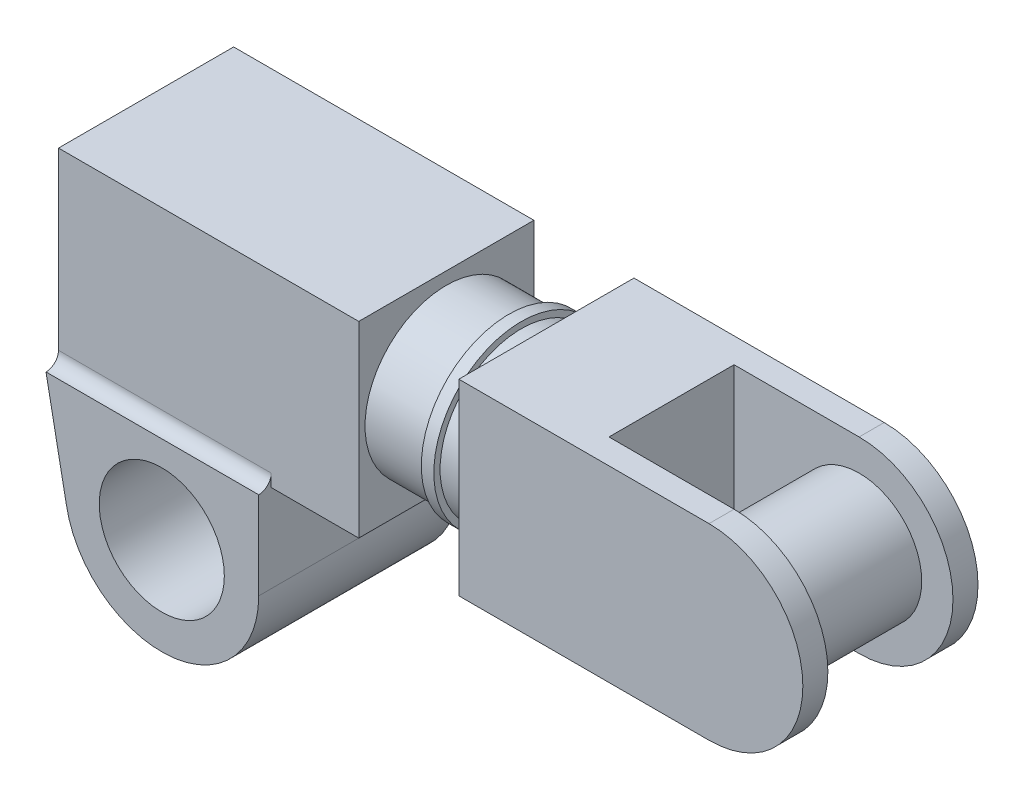
ISO-10303-21;
HEADER;
FILE_DESCRIPTION(('STEP AP214'),'2;1');
FILE_NAME('part.step','',(''),(''),'','','');
FILE_SCHEMA(('AUTOMOTIVE_DESIGN { 1 0 10303 214 1 1 1 1 }'));
ENDSEC;
DATA;
#1=APPLICATION_CONTEXT('core data for automotive mechanical design processes');
#2=APPLICATION_PROTOCOL_DEFINITION('international standard','automotive_design',2000,#1);
#3=PRODUCT_CONTEXT('',#1,'mechanical');
#4=PRODUCT('Part','Part','',(#3));
#5=PRODUCT_RELATED_PRODUCT_CATEGORY('part','',(#4));
#6=PRODUCT_DEFINITION_FORMATION('','',#4);
#7=PRODUCT_DEFINITION_CONTEXT('part definition',#1,'design');
#8=PRODUCT_DEFINITION('design','',#6,#7);
#9=PRODUCT_DEFINITION_SHAPE('','',#8);
#10=(LENGTH_UNIT() NAMED_UNIT(*) SI_UNIT(.MILLI.,.METRE.));
#11=(NAMED_UNIT(*) PLANE_ANGLE_UNIT() SI_UNIT($,.RADIAN.));
#12=(NAMED_UNIT(*) SI_UNIT($,.STERADIAN.) SOLID_ANGLE_UNIT());
#13=UNCERTAINTY_MEASURE_WITH_UNIT(LENGTH_MEASURE(1.E-05),#10,'distance_accuracy_value','');
#14=(GEOMETRIC_REPRESENTATION_CONTEXT(3) GLOBAL_UNCERTAINTY_ASSIGNED_CONTEXT((#13)) GLOBAL_UNIT_ASSIGNED_CONTEXT((#10,
#11,#12)) REPRESENTATION_CONTEXT('',''));
#15=CARTESIAN_POINT('',(0.,0.,0.));
#16=DIRECTION('',(0.,0.,1.));
#17=DIRECTION('',(1.,0.,0.));
#18=AXIS2_PLACEMENT_3D('',#15,#16,#17);
#19=CARTESIAN_POINT('',(320.,75.,70.));
#20=DIRECTION('',(0.,-1.,0.));
#21=DIRECTION('',(1.,0.,0.));
#22=AXIS2_PLACEMENT_3D('',#19,#20,#21);
#23=PLANE('',#22);
#24=DIRECTION('',(-1.,0.,0.));
#25=VECTOR('',#24,1.);
#26=CARTESIAN_POINT('',(520.,75.,-50.));
#27=LINE('',#26,#25);
#28=CARTESIAN_POINT('',(520.,75.,-50.));
#29=VERTEX_POINT('',#28);
#30=CARTESIAN_POINT('',(420.,75.,-50.));
#31=VERTEX_POINT('',#30);
#32=EDGE_CURVE('E356',#29,#31,#27,.T.);
#33=ORIENTED_EDGE('',*,*,#32,.F.);
#34=DIRECTION('',(0.,0.,-1.));
#35=VECTOR('',#34,1.);
#36=CARTESIAN_POINT('',(520.,75.,70.));
#37=LINE('',#36,#35);
#38=CARTESIAN_POINT('',(520.,75.,-70.));
#39=VERTEX_POINT('',#38);
#40=EDGE_CURVE('E293',#29,#39,#37,.T.);
#41=ORIENTED_EDGE('',*,*,#40,.T.);
#42=DIRECTION('',(-1.,0.,0.));
#43=VECTOR('',#42,1.);
#44=CARTESIAN_POINT('',(320.,75.,-70.));
#45=LINE('',#44,#43);
#46=CARTESIAN_POINT('',(320.,75.,-70.));
#47=VERTEX_POINT('',#46);
#48=EDGE_CURVE('E307',#39,#47,#45,.T.);
#49=ORIENTED_EDGE('',*,*,#48,.T.);
#50=DIRECTION('',(0.,0.,-1.));
#51=VECTOR('',#50,1.);
#52=CARTESIAN_POINT('',(320.,75.,70.));
#53=LINE('',#52,#51);
#54=CARTESIAN_POINT('',(320.,75.,70.));
#55=VERTEX_POINT('',#54);
#56=EDGE_CURVE('E276',#55,#47,#53,.T.);
#57=ORIENTED_EDGE('',*,*,#56,.F.);
#58=DIRECTION('',(-1.,0.,0.));
#59=VECTOR('',#58,1.);
#60=CARTESIAN_POINT('',(320.,75.,70.));
#61=LINE('',#60,#59);
#62=CARTESIAN_POINT('',(520.,75.,70.));
#63=VERTEX_POINT('',#62);
#64=EDGE_CURVE('E298',#63,#55,#61,.T.);
#65=ORIENTED_EDGE('',*,*,#64,.F.);
#66=CARTESIAN_POINT('',(520.,75.,50.));
#67=VERTEX_POINT('',#66);
#68=EDGE_CURVE('E289',#63,#67,#37,.T.);
#69=ORIENTED_EDGE('',*,*,#68,.T.);
#70=DIRECTION('',(-1.,0.,0.));
#71=VECTOR('',#70,1.);
#72=CARTESIAN_POINT('',(520.,75.,50.));
#73=LINE('',#72,#71);
#74=CARTESIAN_POINT('',(420.,75.,50.));
#75=VERTEX_POINT('',#74);
#76=EDGE_CURVE('E58',#67,#75,#73,.T.);
#77=ORIENTED_EDGE('',*,*,#76,.T.);
#78=DIRECTION('',(0.,0.,1.));
#79=VECTOR('',#78,1.);
#80=CARTESIAN_POINT('',(420.,75.,-50.));
#81=LINE('',#80,#79);
#82=EDGE_CURVE('E327',#31,#75,#81,.T.);
#83=ORIENTED_EDGE('',*,*,#82,.F.);
#84=EDGE_LOOP('',(#33,#41,#49,#57,#65,#69,#77,#83));
#85=FACE_BOUND('',#84,.T.);
#86=ADVANCED_FACE('F42',(#85),#23,.F.);
#87=CARTESIAN_POINT('',(520.,-75.,70.));
#88=DIRECTION('',(0.,1.,0.));
#89=DIRECTION('',(-1.,0.,0.));
#90=AXIS2_PLACEMENT_3D('',#87,#88,#89);
#91=PLANE('',#90);
#92=DIRECTION('',(1.,0.,0.));
#93=VECTOR('',#92,1.);
#94=CARTESIAN_POINT('',(420.,-75.,-50.));
#95=LINE('',#94,#93);
#96=CARTESIAN_POINT('',(420.,-75.,-50.));
#97=VERTEX_POINT('',#96);
#98=CARTESIAN_POINT('',(520.,-75.,-50.));
#99=VERTEX_POINT('',#98);
#100=EDGE_CURVE('E331',#97,#99,#95,.T.);
#101=ORIENTED_EDGE('',*,*,#100,.F.);
#102=DIRECTION('',(0.,0.,1.));
#103=VECTOR('',#102,1.);
#104=CARTESIAN_POINT('',(420.,-75.,-50.));
#105=LINE('',#104,#103);
#106=CARTESIAN_POINT('',(420.,-75.,50.));
#107=VERTEX_POINT('',#106);
#108=EDGE_CURVE('E311',#97,#107,#105,.T.);
#109=ORIENTED_EDGE('',*,*,#108,.T.);
#110=DIRECTION('',(1.,0.,0.));
#111=VECTOR('',#110,1.);
#112=CARTESIAN_POINT('',(420.,-75.,50.));
#113=LINE('',#112,#111);
#114=CARTESIAN_POINT('',(520.,-75.,50.));
#115=VERTEX_POINT('',#114);
#116=EDGE_CURVE('E335',#107,#115,#113,.T.);
#117=ORIENTED_EDGE('',*,*,#116,.T.);
#118=DIRECTION('',(0.,0.,-1.));
#119=VECTOR('',#118,1.);
#120=CARTESIAN_POINT('',(520.,-75.,70.));
#121=LINE('',#120,#119);
#122=CARTESIAN_POINT('',(520.,-75.,70.));
#123=VERTEX_POINT('',#122);
#124=EDGE_CURVE('E284',#123,#115,#121,.T.);
#125=ORIENTED_EDGE('',*,*,#124,.F.);
#126=DIRECTION('',(1.,0.,0.));
#127=VECTOR('',#126,1.);
#128=CARTESIAN_POINT('',(520.,-75.,70.));
#129=LINE('',#128,#127);
#130=CARTESIAN_POINT('',(320.,-75.,70.));
#131=VERTEX_POINT('',#130);
#132=EDGE_CURVE('E316',#131,#123,#129,.T.);
#133=ORIENTED_EDGE('',*,*,#132,.F.);
#134=DIRECTION('',(0.,0.,-1.));
#135=VECTOR('',#134,1.);
#136=CARTESIAN_POINT('',(320.,-75.,70.));
#137=LINE('',#136,#135);
#138=CARTESIAN_POINT('',(320.,-75.,-70.));
#139=VERTEX_POINT('',#138);
#140=EDGE_CURVE('E280',#131,#139,#137,.T.);
#141=ORIENTED_EDGE('',*,*,#140,.T.);
#142=DIRECTION('',(1.,0.,0.));
#143=VECTOR('',#142,1.);
#144=CARTESIAN_POINT('',(520.,-75.,-70.));
#145=LINE('',#144,#143);
#146=CARTESIAN_POINT('',(520.,-75.,-70.));
#147=VERTEX_POINT('',#146);
#148=EDGE_CURVE('E299',#139,#147,#145,.T.);
#149=ORIENTED_EDGE('',*,*,#148,.T.);
#150=EDGE_CURVE('E288',#99,#147,#121,.T.);
#151=ORIENTED_EDGE('',*,*,#150,.F.);
#152=EDGE_LOOP('',(#101,#109,#117,#125,#133,#141,#149,#151));
#153=FACE_BOUND('',#152,.T.);
#154=ADVANCED_FACE('F429',(#153),#91,.F.);
#155=CARTESIAN_POINT('',(520.,0.,70.));
#156=DIRECTION('',(0.,0.,-1.));
#157=DIRECTION('',(-1.,0.,0.));
#158=AXIS2_PLACEMENT_3D('',#155,#156,#157);
#159=CYLINDRICAL_SURFACE('',#158,75.);
#160=CARTESIAN_POINT('',(520.,0.,-50.));
#161=DIRECTION('',(0.,0.,1.));
#162=DIRECTION('',(1.,0.,0.));
#163=AXIS2_PLACEMENT_3D('',#160,#161,#162);
#164=CIRCLE('',#163,75.);
#165=EDGE_CURVE('E339',#99,#29,#164,.T.);
#166=ORIENTED_EDGE('',*,*,#165,.F.);
#167=ORIENTED_EDGE('',*,*,#150,.T.);
#168=CARTESIAN_POINT('',(520.,0.,-70.));
#169=DIRECTION('',(0.,0.,1.));
#170=DIRECTION('',(1.,0.,0.));
#171=AXIS2_PLACEMENT_3D('',#168,#169,#170);
#172=CIRCLE('',#171,75.);
#173=EDGE_CURVE('E294',#147,#39,#172,.T.);
#174=ORIENTED_EDGE('',*,*,#173,.T.);
#175=ORIENTED_EDGE('',*,*,#40,.F.);
#176=EDGE_LOOP('',(#166,#167,#174,#175));
#177=FACE_BOUND('',#176,.T.);
#178=ADVANCED_FACE('F393',(#177),#159,.T.);
#179=CARTESIAN_POINT('',(240.,-75.,70.));
#180=DIRECTION('',(0.,0.,-1.));
#181=DIRECTION('',(-1.,0.,0.));
#182=AXIS2_PLACEMENT_3D('',#179,#180,#181);
#183=PLANE('',#182);
#184=DIRECTION('',(0.,-1.,0.));
#185=VECTOR('',#184,1.);
#186=CARTESIAN_POINT('',(0.,-75.,70.));
#187=LINE('',#186,#185);
#188=CARTESIAN_POINT('',(0.,75.,70.));
#189=VERTEX_POINT('',#188);
#190=CARTESIAN_POINT('',(0.,-65.,70.));
#191=VERTEX_POINT('',#190);
#192=EDGE_CURVE('E150',#189,#191,#187,.T.);
#193=ORIENTED_EDGE('',*,*,#192,.T.);
#194=DIRECTION('',(-1.,0.,0.));
#195=VECTOR('',#194,1.);
#196=CARTESIAN_POINT('',(170.044787747247,-65.,70.));
#197=LINE('',#196,#195);
#198=CARTESIAN_POINT('',(170.044787747247,-65.,70.));
#199=VERTEX_POINT('',#198);
#200=EDGE_CURVE('E144',#191,#199,#197,.F.);
#201=ORIENTED_EDGE('',*,*,#200,.T.);
#202=DIRECTION('',(0.,-1.,0.));
#203=VECTOR('',#202,1.);
#204=CARTESIAN_POINT('',(170.044787747247,-145.,70.));
#205=LINE('',#204,#203);
#206=CARTESIAN_POINT('',(170.044787747247,-75.,70.));
#207=VERTEX_POINT('',#206);
#208=EDGE_CURVE('E135',#199,#207,#205,.T.);
#209=ORIENTED_EDGE('',*,*,#208,.T.);
#210=DIRECTION('',(-1.,0.,0.));
#211=VECTOR('',#210,1.);
#212=CARTESIAN_POINT('',(240.,-75.,70.));
#213=LINE('',#212,#211);
#214=CARTESIAN_POINT('',(240.,-75.,70.));
#215=VERTEX_POINT('',#214);
#216=EDGE_CURVE('E176',#215,#207,#213,.T.);
#217=ORIENTED_EDGE('',*,*,#216,.F.);
#218=DIRECTION('',(0.,-1.,0.));
#219=VECTOR('',#218,1.);
#220=CARTESIAN_POINT('',(240.,-75.,70.));
#221=LINE('',#220,#219);
#222=CARTESIAN_POINT('',(240.,75.,70.));
#223=VERTEX_POINT('',#222);
#224=EDGE_CURVE('E194',#223,#215,#221,.T.);
#225=ORIENTED_EDGE('',*,*,#224,.F.);
#226=DIRECTION('',(-1.,0.,0.));
#227=VECTOR('',#226,1.);
#228=CARTESIAN_POINT('',(240.,75.,70.));
#229=LINE('',#228,#227);
#230=EDGE_CURVE('E187',#223,#189,#229,.T.);
#231=ORIENTED_EDGE('',*,*,#230,.T.);
#232=EDGE_LOOP('',(#193,#201,#209,#217,#225,#231));
#233=FACE_BOUND('',#232,.T.);
#234=ADVANCED_FACE('F148',(#233),#183,.F.);
#235=CARTESIAN_POINT('',(240.,-75.,-70.));
#236=DIRECTION('',(0.,1.,0.));
#237=DIRECTION('',(0.,0.,1.));
#238=AXIS2_PLACEMENT_3D('',#235,#236,#237);
#239=PLANE('',#238);
#240=ORIENTED_EDGE('',*,*,#216,.T.);
#241=DIRECTION('',(0.,0.,-1.));
#242=VECTOR('',#241,1.);
#243=CARTESIAN_POINT('',(170.044787747247,-75.,80.));
#244=LINE('',#243,#242);
#245=CARTESIAN_POINT('',(170.044787747247,-75.,-70.));
#246=VERTEX_POINT('',#245);
#247=EDGE_CURVE('E139',#207,#246,#244,.T.);
#248=ORIENTED_EDGE('',*,*,#247,.T.);
#249=DIRECTION('',(-1.,0.,0.));
#250=VECTOR('',#249,1.);
#251=CARTESIAN_POINT('',(240.,-75.,-70.));
#252=LINE('',#251,#250);
#253=CARTESIAN_POINT('',(240.,-75.,-70.));
#254=VERTEX_POINT('',#253);
#255=EDGE_CURVE('E180',#254,#246,#252,.T.);
#256=ORIENTED_EDGE('',*,*,#255,.F.);
#257=DIRECTION('',(0.,0.,-1.));
#258=VECTOR('',#257,1.);
#259=CARTESIAN_POINT('',(240.,-75.,-70.));
#260=LINE('',#259,#258);
#261=EDGE_CURVE('E208',#215,#254,#260,.T.);
#262=ORIENTED_EDGE('',*,*,#261,.F.);
#263=EDGE_LOOP('',(#240,#248,#256,#262));
#264=FACE_BOUND('',#263,.T.);
#265=ADVANCED_FACE('F517',(#264),#239,.F.);
#266=CARTESIAN_POINT('',(240.,-75.,-70.));
#267=DIRECTION('',(0.,0.,1.));
#268=DIRECTION('',(1.,0.,0.));
#269=AXIS2_PLACEMENT_3D('',#266,#267,#268);
#270=PLANE('',#269);
#271=DIRECTION('',(0.,1.,0.));
#272=VECTOR('',#271,1.);
#273=CARTESIAN_POINT('',(170.044787747247,-145.,-70.));
#274=LINE('',#273,#272);
#275=CARTESIAN_POINT('',(170.044787747247,-65.,-70.));
#276=VERTEX_POINT('',#275);
#277=EDGE_CURVE('E67',#246,#276,#274,.T.);
#278=ORIENTED_EDGE('',*,*,#277,.T.);
#279=DIRECTION('',(-1.,0.,0.));
#280=VECTOR('',#279,1.);
#281=CARTESIAN_POINT('',(0.,-65.,-70.));
#282=LINE('',#281,#280);
#283=CARTESIAN_POINT('',(0.,-65.,-70.));
#284=VERTEX_POINT('',#283);
#285=EDGE_CURVE('E145',#276,#284,#282,.T.);
#286=ORIENTED_EDGE('',*,*,#285,.T.);
#287=DIRECTION('',(0.,1.,0.));
#288=VECTOR('',#287,1.);
#289=CARTESIAN_POINT('',(0.,-75.,-70.));
#290=LINE('',#289,#288);
#291=CARTESIAN_POINT('',(0.,75.,-70.));
#292=VERTEX_POINT('',#291);
#293=EDGE_CURVE('E195',#284,#292,#290,.T.);
#294=ORIENTED_EDGE('',*,*,#293,.T.);
#295=DIRECTION('',(-1.,0.,0.));
#296=VECTOR('',#295,1.);
#297=CARTESIAN_POINT('',(240.,75.,-70.));
#298=LINE('',#297,#296);
#299=CARTESIAN_POINT('',(240.,75.,-70.));
#300=VERTEX_POINT('',#299);
#301=EDGE_CURVE('E183',#300,#292,#298,.T.);
#302=ORIENTED_EDGE('',*,*,#301,.F.);
#303=DIRECTION('',(0.,1.,0.));
#304=VECTOR('',#303,1.);
#305=CARTESIAN_POINT('',(240.,-75.,-70.));
#306=LINE('',#305,#304);
#307=EDGE_CURVE('E205',#254,#300,#306,.T.);
#308=ORIENTED_EDGE('',*,*,#307,.F.);
#309=ORIENTED_EDGE('',*,*,#255,.T.);
#310=EDGE_LOOP('',(#278,#286,#294,#302,#308,#309));
#311=FACE_BOUND('',#310,.T.);
#312=ADVANCED_FACE('F513',(#311),#270,.F.);
#313=CARTESIAN_POINT('',(240.,75.,-70.));
#314=DIRECTION('',(0.,-1.,0.));
#315=DIRECTION('',(0.,0.,-1.));
#316=AXIS2_PLACEMENT_3D('',#313,#314,#315);
#317=PLANE('',#316);
#318=DIRECTION('',(0.,0.,1.));
#319=VECTOR('',#318,1.);
#320=CARTESIAN_POINT('',(0.,75.,-70.));
#321=LINE('',#320,#319);
#322=EDGE_CURVE('E191',#292,#189,#321,.T.);
#323=ORIENTED_EDGE('',*,*,#322,.T.);
#324=ORIENTED_EDGE('',*,*,#230,.F.);
#325=DIRECTION('',(0.,0.,1.));
#326=VECTOR('',#325,1.);
#327=CARTESIAN_POINT('',(240.,75.,-70.));
#328=LINE('',#327,#326);
#329=EDGE_CURVE('E190',#300,#223,#328,.T.);
#330=ORIENTED_EDGE('',*,*,#329,.F.);
#331=ORIENTED_EDGE('',*,*,#301,.T.);
#332=EDGE_LOOP('',(#323,#324,#330,#331));
#333=FACE_BOUND('',#332,.T.);
#334=ADVANCED_FACE('F507',(#333),#317,.F.);
#335=CARTESIAN_POINT('',(240.,0.,0.));
#336=DIRECTION('',(1.,0.,0.));
#337=DIRECTION('',(0.,0.,-1.));
#338=AXIS2_PLACEMENT_3D('',#335,#336,#337);
#339=PLANE('',#338);
#340=CARTESIAN_POINT('',(240.,0.,0.));
#341=DIRECTION('',(1.,0.,0.));
#342=DIRECTION('',(0.,0.,-1.));
#343=AXIS2_PLACEMENT_3D('',#340,#341,#342);
#344=CIRCLE('',#343,65.);
#345=CARTESIAN_POINT('',(240.,0.,-65.));
#346=VERTEX_POINT('',#345);
#347=EDGE_CURVE('E179',#346,#346,#344,.T.);
#348=ORIENTED_EDGE('',*,*,#347,.F.);
#349=EDGE_LOOP('',(#348));
#350=FACE_BOUND('',#349,.T.);
#351=ORIENTED_EDGE('',*,*,#224,.T.);
#352=ORIENTED_EDGE('',*,*,#261,.T.);
#353=ORIENTED_EDGE('',*,*,#307,.T.);
#354=ORIENTED_EDGE('',*,*,#329,.T.);
#355=EDGE_LOOP('',(#351,#352,#353,#354));
#356=FACE_BOUND('',#355,.T.);
#357=ADVANCED_FACE('F504',(#350,#356),#339,.T.);
#358=CARTESIAN_POINT('',(0.,0.,0.));
#359=DIRECTION('',(1.,0.,0.));
#360=DIRECTION('',(0.,0.,-1.));
#361=AXIS2_PLACEMENT_3D('',#358,#359,#360);
#362=PLANE('',#361);
#363=ORIENTED_EDGE('',*,*,#192,.F.);
#364=ORIENTED_EDGE('',*,*,#322,.F.);
#365=ORIENTED_EDGE('',*,*,#293,.F.);
#366=CARTESIAN_POINT('',(0.,-65.,-80.));
#367=DIRECTION('',(1.,0.,0.));
#368=DIRECTION('',(0.,0.,-1.));
#369=AXIS2_PLACEMENT_3D('',#366,#367,#368);
#370=CIRCLE('',#369,10.);
#371=CARTESIAN_POINT('',(0.,-75.,-80.));
#372=VERTEX_POINT('',#371);
#373=EDGE_CURVE('E153',#284,#372,#370,.T.);
#374=ORIENTED_EDGE('',*,*,#373,.T.);
#375=DIRECTION('',(0.,0.,-1.));
#376=VECTOR('',#375,1.);
#377=CARTESIAN_POINT('',(0.,-75.,-70.));
#378=LINE('',#377,#376);
#379=CARTESIAN_POINT('',(0.,-75.,80.));
#380=VERTEX_POINT('',#379);
#381=EDGE_CURVE('E81',#380,#372,#378,.T.);
#382=ORIENTED_EDGE('',*,*,#381,.F.);
#383=CARTESIAN_POINT('',(0.,-65.,80.));
#384=DIRECTION('',(1.,0.,0.));
#385=DIRECTION('',(0.,0.,-1.));
#386=AXIS2_PLACEMENT_3D('',#383,#384,#385);
#387=CIRCLE('',#386,10.);
#388=EDGE_CURVE('E133',#380,#191,#387,.T.);
#389=ORIENTED_EDGE('',*,*,#388,.T.);
#390=EDGE_LOOP('',(#363,#364,#365,#374,#382,#389));
#391=FACE_BOUND('',#390,.T.);
#392=ADVANCED_FACE('F502',(#391),#362,.F.);
#393=CARTESIAN_POINT('',(290.,0.,0.));
#394=DIRECTION('',(-1.,0.,0.));
#395=DIRECTION('',(0.,0.,1.));
#396=AXIS2_PLACEMENT_3D('',#393,#394,#395);
#397=CYLINDRICAL_SURFACE('',#396,65.);
#398=CARTESIAN_POINT('',(290.,0.,0.));
#399=DIRECTION('',(1.,0.,0.));
#400=DIRECTION('',(0.,0.,-1.));
#401=AXIS2_PLACEMENT_3D('',#398,#399,#400);
#402=CIRCLE('',#401,65.);
#403=CARTESIAN_POINT('',(290.,0.,-65.));
#404=VERTEX_POINT('',#403);
#405=EDGE_CURVE('E202',#404,#404,#402,.T.);
#406=ORIENTED_EDGE('',*,*,#405,.F.);
#407=EDGE_LOOP('',(#406));
#408=FACE_BOUND('',#407,.T.);
#409=ORIENTED_EDGE('',*,*,#347,.T.);
#410=EDGE_LOOP('',(#409));
#411=FACE_BOUND('',#410,.T.);
#412=ADVANCED_FACE('F498',(#408,#411),#397,.T.);
#413=CARTESIAN_POINT('',(300.,0.,0.));
#414=DIRECTION('',(-1.,0.,0.));
#415=DIRECTION('',(0.,0.,1.));
#416=AXIS2_PLACEMENT_3D('',#413,#414,#415);
#417=CYLINDRICAL_SURFACE('',#416,70.);
#418=CARTESIAN_POINT('',(300.,0.,0.));
#419=DIRECTION('',(1.,0.,0.));
#420=DIRECTION('',(0.,0.,-1.));
#421=AXIS2_PLACEMENT_3D('',#418,#419,#420);
#422=CIRCLE('',#421,70.);
#423=CARTESIAN_POINT('',(300.,0.,-70.));
#424=VERTEX_POINT('',#423);
#425=EDGE_CURVE('E220',#424,#424,#422,.T.);
#426=ORIENTED_EDGE('',*,*,#425,.F.);
#427=EDGE_LOOP('',(#426));
#428=FACE_BOUND('',#427,.T.);
#429=CARTESIAN_POINT('',(290.,0.,0.));
#430=DIRECTION('',(1.,0.,0.));
#431=DIRECTION('',(0.,0.,-1.));
#432=AXIS2_PLACEMENT_3D('',#429,#430,#431);
#433=CIRCLE('',#432,70.);
#434=CARTESIAN_POINT('',(290.,0.,-70.));
#435=VERTEX_POINT('',#434);
#436=EDGE_CURVE('E221',#435,#435,#433,.T.);
#437=ORIENTED_EDGE('',*,*,#436,.T.);
#438=EDGE_LOOP('',(#437));
#439=FACE_BOUND('',#438,.T.);
#440=ADVANCED_FACE('F491',(#428,#439),#417,.T.);
#441=CARTESIAN_POINT('',(300.,0.,0.));
#442=DIRECTION('',(1.,0.,0.));
#443=DIRECTION('',(0.,0.,-1.));
#444=AXIS2_PLACEMENT_3D('',#441,#442,#443);
#445=PLANE('',#444);
#446=CARTESIAN_POINT('',(300.,0.,0.));
#447=DIRECTION('',(1.,0.,0.));
#448=DIRECTION('',(0.,0.,-1.));
#449=AXIS2_PLACEMENT_3D('',#446,#447,#448);
#450=CIRCLE('',#449,65.);
#451=CARTESIAN_POINT('',(300.,0.,-65.));
#452=VERTEX_POINT('',#451);
#453=EDGE_CURVE('E51',#452,#452,#450,.T.);
#454=ORIENTED_EDGE('',*,*,#453,.F.);
#455=EDGE_LOOP('',(#454));
#456=FACE_BOUND('',#455,.T.);
#457=ORIENTED_EDGE('',*,*,#425,.T.);
#458=EDGE_LOOP('',(#457));
#459=FACE_BOUND('',#458,.T.);
#460=ADVANCED_FACE('F488',(#456,#459),#445,.T.);
#461=CARTESIAN_POINT('',(290.,0.,0.));
#462=DIRECTION('',(1.,0.,0.));
#463=DIRECTION('',(0.,0.,-1.));
#464=AXIS2_PLACEMENT_3D('',#461,#462,#463);
#465=PLANE('',#464);
#466=ORIENTED_EDGE('',*,*,#405,.T.);
#467=EDGE_LOOP('',(#466));
#468=FACE_BOUND('',#467,.T.);
#469=ORIENTED_EDGE('',*,*,#436,.F.);
#470=EDGE_LOOP('',(#469));
#471=FACE_BOUND('',#470,.T.);
#472=ADVANCED_FACE('F474',(#468,#471),#465,.F.);
#473=CARTESIAN_POINT('',(92.5447877472473,-145.,80.));
#474=DIRECTION('',(0.,0.,1.));
#475=DIRECTION('',(1.,0.,0.));
#476=AXIS2_PLACEMENT_3D('',#473,#474,#475);
#477=PLANE('',#476);
#478=CARTESIAN_POINT('',(92.5447877472473,-145.,80.));
#479=DIRECTION('',(0.,0.,1.));
#480=DIRECTION('',(1.,0.,0.));
#481=AXIS2_PLACEMENT_3D('',#478,#479,#480);
#482=CIRCLE('',#481,77.5);
#483=CARTESIAN_POINT('',(16.2187646070058,-158.438310593052,80.));
#484=VERTEX_POINT('',#483);
#485=CARTESIAN_POINT('',(170.044787747247,-145.,80.));
#486=VERTEX_POINT('',#485);
#487=EDGE_CURVE('E242',#484,#486,#482,.T.);
#488=ORIENTED_EDGE('',*,*,#487,.T.);
#489=DIRECTION('',(0.,1.,0.));
#490=VECTOR('',#489,1.);
#491=CARTESIAN_POINT('',(170.044787747247,-145.,80.));
#492=LINE('',#491,#490);
#493=CARTESIAN_POINT('',(170.044787747247,-75.,80.));
#494=VERTEX_POINT('',#493);
#495=EDGE_CURVE('E259',#486,#494,#492,.T.);
#496=ORIENTED_EDGE('',*,*,#495,.T.);
#497=DIRECTION('',(-1.,0.,0.));
#498=VECTOR('',#497,1.);
#499=CARTESIAN_POINT('',(170.044787747247,-75.,80.));
#500=LINE('',#499,#498);
#501=EDGE_CURVE('E157',#494,#380,#500,.T.);
#502=ORIENTED_EDGE('',*,*,#501,.T.);
#503=DIRECTION('',(0.190808995376538,-0.981627183447665,0.));
#504=VECTOR('',#503,1.);
#505=CARTESIAN_POINT('',(16.2187646070058,-158.438310593052,80.));
#506=LINE('',#505,#504);
#507=EDGE_CURVE('E238',#380,#484,#506,.T.);
#508=ORIENTED_EDGE('',*,*,#507,.T.);
#509=EDGE_LOOP('',(#488,#496,#502,#508));
#510=FACE_BOUND('',#509,.T.);
#511=CARTESIAN_POINT('',(92.5447877472473,-145.,80.));
#512=DIRECTION('',(0.,0.,1.));
#513=DIRECTION('',(1.,0.,0.));
#514=AXIS2_PLACEMENT_3D('',#511,#512,#513);
#515=CIRCLE('',#514,50.);
#516=CARTESIAN_POINT('',(142.544787747247,-145.,80.));
#517=VERTEX_POINT('',#516);
#518=EDGE_CURVE('E254',#517,#517,#515,.T.);
#519=ORIENTED_EDGE('',*,*,#518,.F.);
#520=EDGE_LOOP('',(#519));
#521=FACE_BOUND('',#520,.T.);
#522=ADVANCED_FACE('F470',(#510,#521),#477,.T.);
#523=CARTESIAN_POINT('',(92.5447877472473,-145.,-80.));
#524=DIRECTION('',(0.,0.,1.));
#525=DIRECTION('',(1.,0.,0.));
#526=AXIS2_PLACEMENT_3D('',#523,#524,#525);
#527=PLANE('',#526);
#528=CARTESIAN_POINT('',(92.5447877472473,-145.,-80.));
#529=DIRECTION('',(0.,0.,1.));
#530=DIRECTION('',(1.,0.,0.));
#531=AXIS2_PLACEMENT_3D('',#528,#529,#530);
#532=CIRCLE('',#531,77.5);
#533=CARTESIAN_POINT('',(16.2187646070058,-158.438310593052,-80.));
#534=VERTEX_POINT('',#533);
#535=CARTESIAN_POINT('',(170.044787747247,-145.,-80.));
#536=VERTEX_POINT('',#535);
#537=EDGE_CURVE('E250',#534,#536,#532,.T.);
#538=ORIENTED_EDGE('',*,*,#537,.F.);
#539=DIRECTION('',(0.190808995376538,-0.981627183447665,0.));
#540=VECTOR('',#539,1.);
#541=CARTESIAN_POINT('',(16.2187646070058,-158.438310593052,-80.));
#542=LINE('',#541,#540);
#543=EDGE_CURVE('E239',#372,#534,#542,.T.);
#544=ORIENTED_EDGE('',*,*,#543,.F.);
#545=DIRECTION('',(-1.,0.,0.));
#546=VECTOR('',#545,1.);
#547=CARTESIAN_POINT('',(170.044787747247,-75.,-80.));
#548=LINE('',#547,#546);
#549=CARTESIAN_POINT('',(170.044787747247,-75.,-80.));
#550=VERTEX_POINT('',#549);
#551=EDGE_CURVE('E243',#550,#372,#548,.T.);
#552=ORIENTED_EDGE('',*,*,#551,.F.);
#553=DIRECTION('',(0.,1.,0.));
#554=VECTOR('',#553,1.);
#555=CARTESIAN_POINT('',(170.044787747247,-145.,-80.));
#556=LINE('',#555,#554);
#557=EDGE_CURVE('E247',#536,#550,#556,.T.);
#558=ORIENTED_EDGE('',*,*,#557,.F.);
#559=EDGE_LOOP('',(#538,#544,#552,#558));
#560=FACE_BOUND('',#559,.T.);
#561=CARTESIAN_POINT('',(92.5447877472473,-145.,-80.));
#562=DIRECTION('',(0.,0.,1.));
#563=DIRECTION('',(1.,0.,0.));
#564=AXIS2_PLACEMENT_3D('',#561,#562,#563);
#565=CIRCLE('',#564,50.);
#566=CARTESIAN_POINT('',(142.544787747247,-145.,-80.));
#567=VERTEX_POINT('',#566);
#568=EDGE_CURVE('E265',#567,#567,#565,.T.);
#569=ORIENTED_EDGE('',*,*,#568,.T.);
#570=EDGE_LOOP('',(#569));
#571=FACE_BOUND('',#570,.T.);
#572=ADVANCED_FACE('F473',(#560,#571),#527,.F.);
#573=CARTESIAN_POINT('',(92.5447877472473,-145.,80.));
#574=DIRECTION('',(0.,0.,-1.));
#575=DIRECTION('',(-1.,0.,0.));
#576=AXIS2_PLACEMENT_3D('',#573,#574,#575);
#577=CYLINDRICAL_SURFACE('',#576,77.5);
#578=ORIENTED_EDGE('',*,*,#537,.T.);
#579=DIRECTION('',(0.,0.,-1.));
#580=VECTOR('',#579,1.);
#581=CARTESIAN_POINT('',(170.044787747247,-145.,80.));
#582=LINE('',#581,#580);
#583=EDGE_CURVE('E225',#486,#536,#582,.T.);
#584=ORIENTED_EDGE('',*,*,#583,.F.);
#585=ORIENTED_EDGE('',*,*,#487,.F.);
#586=DIRECTION('',(0.,0.,-1.));
#587=VECTOR('',#586,1.);
#588=CARTESIAN_POINT('',(16.2187646070058,-158.438310593052,80.));
#589=LINE('',#588,#587);
#590=EDGE_CURVE('E232',#484,#534,#589,.T.);
#591=ORIENTED_EDGE('',*,*,#590,.T.);
#592=EDGE_LOOP('',(#578,#584,#585,#591));
#593=FACE_BOUND('',#592,.T.);
#594=ADVANCED_FACE('F478',(#593),#577,.T.);
#595=CARTESIAN_POINT('',(170.044787747247,-145.,80.));
#596=DIRECTION('',(-1.,0.,0.));
#597=DIRECTION('',(0.,0.,1.));
#598=AXIS2_PLACEMENT_3D('',#595,#596,#597);
#599=PLANE('',#598);
#600=ORIENTED_EDGE('',*,*,#557,.T.);
#601=CARTESIAN_POINT('',(170.044787747247,-65.,-80.));
#602=DIRECTION('',(-1.,0.,0.));
#603=DIRECTION('',(0.,0.,1.));
#604=AXIS2_PLACEMENT_3D('',#601,#602,#603);
#605=CIRCLE('',#604,10.);
#606=EDGE_CURVE('E165',#550,#276,#605,.T.);
#607=ORIENTED_EDGE('',*,*,#606,.T.);
#608=ORIENTED_EDGE('',*,*,#277,.F.);
#609=ORIENTED_EDGE('',*,*,#247,.F.);
#610=ORIENTED_EDGE('',*,*,#208,.F.);
#611=CARTESIAN_POINT('',(170.044787747247,-65.,80.));
#612=DIRECTION('',(-1.,0.,0.));
#613=DIRECTION('',(0.,0.,1.));
#614=AXIS2_PLACEMENT_3D('',#611,#612,#613);
#615=CIRCLE('',#614,10.);
#616=EDGE_CURVE('E92',#199,#494,#615,.T.);
#617=ORIENTED_EDGE('',*,*,#616,.T.);
#618=ORIENTED_EDGE('',*,*,#495,.F.);
#619=ORIENTED_EDGE('',*,*,#583,.T.);
#620=EDGE_LOOP('',(#600,#607,#608,#609,#610,#617,#618,#619));
#621=FACE_BOUND('',#620,.T.);
#622=ADVANCED_FACE('F137',(#621),#599,.F.);
#623=CARTESIAN_POINT('',(16.2187646070058,-158.438310593052,80.));
#624=DIRECTION('',(0.981627183447665,0.190808995376538,0.));
#625=DIRECTION('',(-0.190808995376538,0.981627183447665,0.));
#626=AXIS2_PLACEMENT_3D('',#623,#624,#625);
#627=PLANE('',#626);
#628=ORIENTED_EDGE('',*,*,#543,.T.);
#629=ORIENTED_EDGE('',*,*,#590,.F.);
#630=ORIENTED_EDGE('',*,*,#507,.F.);
#631=ORIENTED_EDGE('',*,*,#381,.T.);
#632=EDGE_LOOP('',(#628,#629,#630,#631));
#633=FACE_BOUND('',#632,.T.);
#634=ADVANCED_FACE('F468',(#633),#627,.F.);
#635=CARTESIAN_POINT('',(92.5447877472473,-145.,80.));
#636=DIRECTION('',(0.,0.,-1.));
#637=DIRECTION('',(-1.,0.,0.));
#638=AXIS2_PLACEMENT_3D('',#635,#636,#637);
#639=CYLINDRICAL_SURFACE('',#638,50.);
#640=ORIENTED_EDGE('',*,*,#518,.T.);
#641=EDGE_LOOP('',(#640));
#642=FACE_BOUND('',#641,.T.);
#643=ORIENTED_EDGE('',*,*,#568,.F.);
#644=EDGE_LOOP('',(#643));
#645=FACE_BOUND('',#644,.T.);
#646=ADVANCED_FACE('F464',(#642,#645),#639,.F.);
#647=CARTESIAN_POINT('',(240.,-65.,-80.));
#648=DIRECTION('',(1.,0.,0.));
#649=DIRECTION('',(0.,0.,-1.));
#650=AXIS2_PLACEMENT_3D('',#647,#648,#649);
#651=CYLINDRICAL_SURFACE('',#650,10.);
#652=ORIENTED_EDGE('',*,*,#606,.F.);
#653=ORIENTED_EDGE('',*,*,#551,.T.);
#654=ORIENTED_EDGE('',*,*,#373,.F.);
#655=ORIENTED_EDGE('',*,*,#285,.F.);
#656=EDGE_LOOP('',(#652,#653,#654,#655));
#657=FACE_BOUND('',#656,.T.);
#658=ADVANCED_FACE('F467',(#657),#651,.F.);
#659=CARTESIAN_POINT('',(170.044787747247,-65.,80.));
#660=DIRECTION('',(1.,0.,0.));
#661=DIRECTION('',(0.,0.,-1.));
#662=AXIS2_PLACEMENT_3D('',#659,#660,#661);
#663=CYLINDRICAL_SURFACE('',#662,10.);
#664=ORIENTED_EDGE('',*,*,#616,.F.);
#665=ORIENTED_EDGE('',*,*,#200,.F.);
#666=ORIENTED_EDGE('',*,*,#388,.F.);
#667=ORIENTED_EDGE('',*,*,#501,.F.);
#668=EDGE_LOOP('',(#664,#665,#666,#667));
#669=FACE_BOUND('',#668,.T.);
#670=ADVANCED_FACE('F44',(#669),#663,.F.);
#671=CARTESIAN_POINT('',(320.,0.,0.));
#672=DIRECTION('',(-1.,0.,0.));
#673=DIRECTION('',(0.,0.,1.));
#674=AXIS2_PLACEMENT_3D('',#671,#672,#673);
#675=CYLINDRICAL_SURFACE('',#674,65.);
#676=CARTESIAN_POINT('',(320.,0.,0.));
#677=DIRECTION('',(1.,0.,0.));
#678=DIRECTION('',(0.,0.,-1.));
#679=AXIS2_PLACEMENT_3D('',#676,#677,#678);
#680=CIRCLE('',#679,65.);
#681=CARTESIAN_POINT('',(320.,0.,-65.));
#682=VERTEX_POINT('',#681);
#683=EDGE_CURVE('E269',#682,#682,#680,.T.);
#684=ORIENTED_EDGE('',*,*,#683,.F.);
#685=EDGE_LOOP('',(#684));
#686=FACE_BOUND('',#685,.T.);
#687=ORIENTED_EDGE('',*,*,#453,.T.);
#688=EDGE_LOOP('',(#687));
#689=FACE_BOUND('',#688,.T.);
#690=ADVANCED_FACE('F460',(#686,#689),#675,.T.);
#691=CARTESIAN_POINT('',(320.,-75.,70.));
#692=DIRECTION('',(1.,0.,0.));
#693=DIRECTION('',(0.,0.,-1.));
#694=AXIS2_PLACEMENT_3D('',#691,#692,#693);
#695=PLANE('',#694);
#696=ORIENTED_EDGE('',*,*,#683,.T.);
#697=EDGE_LOOP('',(#696));
#698=FACE_BOUND('',#697,.T.);
#699=DIRECTION('',(0.,-1.,0.));
#700=VECTOR('',#699,1.);
#701=CARTESIAN_POINT('',(320.,-75.,-70.));
#702=LINE('',#701,#700);
#703=EDGE_CURVE('E303',#47,#139,#702,.T.);
#704=ORIENTED_EDGE('',*,*,#703,.T.);
#705=ORIENTED_EDGE('',*,*,#140,.F.);
#706=DIRECTION('',(0.,-1.,0.));
#707=VECTOR('',#706,1.);
#708=CARTESIAN_POINT('',(320.,-75.,70.));
#709=LINE('',#708,#707);
#710=EDGE_CURVE('E320',#55,#131,#709,.T.);
#711=ORIENTED_EDGE('',*,*,#710,.F.);
#712=ORIENTED_EDGE('',*,*,#56,.T.);
#713=EDGE_LOOP('',(#704,#705,#711,#712));
#714=FACE_BOUND('',#713,.T.);
#715=ADVANCED_FACE('F435',(#698,#714),#695,.F.);
#716=ORIENTED_EDGE('',*,*,#124,.T.);
#717=CARTESIAN_POINT('',(520.,0.,50.));
#718=DIRECTION('',(0.,0.,1.));
#719=DIRECTION('',(1.,0.,0.));
#720=AXIS2_PLACEMENT_3D('',#717,#718,#719);
#721=CIRCLE('',#720,75.);
#722=EDGE_CURVE('E345',#115,#67,#721,.T.);
#723=ORIENTED_EDGE('',*,*,#722,.T.);
#724=ORIENTED_EDGE('',*,*,#68,.F.);
#725=CARTESIAN_POINT('',(520.,0.,70.));
#726=DIRECTION('',(0.,0.,1.));
#727=DIRECTION('',(1.,0.,0.));
#728=AXIS2_PLACEMENT_3D('',#725,#726,#727);
#729=CIRCLE('',#728,75.);
#730=EDGE_CURVE('E312',#123,#63,#729,.T.);
#731=ORIENTED_EDGE('',*,*,#730,.F.);
#732=EDGE_LOOP('',(#716,#723,#724,#731));
#733=FACE_BOUND('',#732,.T.);
#734=ADVANCED_FACE('F441',(#733),#159,.T.);
#735=CARTESIAN_POINT('',(520.,0.,70.));
#736=DIRECTION('',(0.,0.,1.));
#737=DIRECTION('',(1.,0.,0.));
#738=AXIS2_PLACEMENT_3D('',#735,#736,#737);
#739=PLANE('',#738);
#740=ORIENTED_EDGE('',*,*,#64,.T.);
#741=ORIENTED_EDGE('',*,*,#710,.T.);
#742=ORIENTED_EDGE('',*,*,#132,.T.);
#743=ORIENTED_EDGE('',*,*,#730,.T.);
#744=EDGE_LOOP('',(#740,#741,#742,#743));
#745=FACE_BOUND('',#744,.T.);
#746=ADVANCED_FACE('F437',(#745),#739,.T.);
#747=CARTESIAN_POINT('',(520.,0.,-70.));
#748=DIRECTION('',(0.,0.,1.));
#749=DIRECTION('',(1.,0.,0.));
#750=AXIS2_PLACEMENT_3D('',#747,#748,#749);
#751=PLANE('',#750);
#752=ORIENTED_EDGE('',*,*,#48,.F.);
#753=ORIENTED_EDGE('',*,*,#173,.F.);
#754=ORIENTED_EDGE('',*,*,#148,.F.);
#755=ORIENTED_EDGE('',*,*,#703,.F.);
#756=EDGE_LOOP('',(#752,#753,#754,#755));
#757=FACE_BOUND('',#756,.T.);
#758=ADVANCED_FACE('F401',(#757),#751,.F.);
#759=CARTESIAN_POINT('',(420.,75.,-50.));
#760=DIRECTION('',(-1.,0.,0.));
#761=DIRECTION('',(0.,0.,1.));
#762=AXIS2_PLACEMENT_3D('',#759,#760,#761);
#763=PLANE('',#762);
#764=DIRECTION('',(0.,-1.,0.));
#765=VECTOR('',#764,1.);
#766=CARTESIAN_POINT('',(420.,75.,50.));
#767=LINE('',#766,#765);
#768=EDGE_CURVE('E340',#75,#107,#767,.T.);
#769=ORIENTED_EDGE('',*,*,#768,.T.);
#770=ORIENTED_EDGE('',*,*,#108,.F.);
#771=DIRECTION('',(0.,-1.,0.));
#772=VECTOR('',#771,1.);
#773=CARTESIAN_POINT('',(420.,75.,-50.));
#774=LINE('',#773,#772);
#775=EDGE_CURVE('E352',#31,#97,#774,.T.);
#776=ORIENTED_EDGE('',*,*,#775,.F.);
#777=ORIENTED_EDGE('',*,*,#82,.T.);
#778=EDGE_LOOP('',(#769,#770,#776,#777));
#779=FACE_BOUND('',#778,.T.);
#780=ADVANCED_FACE('F375',(#779),#763,.F.);
#781=CARTESIAN_POINT('',(520.,0.,-50.));
#782=DIRECTION('',(0.,0.,1.));
#783=DIRECTION('',(1.,0.,0.));
#784=AXIS2_PLACEMENT_3D('',#781,#782,#783);
#785=PLANE('',#784);
#786=CARTESIAN_POINT('',(520.,0.,-50.));
#787=DIRECTION('',(0.,0.,1.));
#788=DIRECTION('',(1.,0.,0.));
#789=AXIS2_PLACEMENT_3D('',#786,#787,#788);
#790=CIRCLE('',#789,50.);
#791=CARTESIAN_POINT('',(570.,0.,-50.));
#792=VERTEX_POINT('',#791);
#793=EDGE_CURVE('E348',#792,#792,#790,.T.);
#794=ORIENTED_EDGE('',*,*,#793,.F.);
#795=EDGE_LOOP('',(#794));
#796=FACE_BOUND('',#795,.T.);
#797=ORIENTED_EDGE('',*,*,#165,.T.);
#798=ORIENTED_EDGE('',*,*,#32,.T.);
#799=ORIENTED_EDGE('',*,*,#775,.T.);
#800=ORIENTED_EDGE('',*,*,#100,.T.);
#801=EDGE_LOOP('',(#797,#798,#799,#800));
#802=FACE_BOUND('',#801,.T.);
#803=ADVANCED_FACE('F371',(#796,#802),#785,.T.);
#804=CARTESIAN_POINT('',(520.,0.,50.));
#805=DIRECTION('',(0.,0.,1.));
#806=DIRECTION('',(1.,0.,0.));
#807=AXIS2_PLACEMENT_3D('',#804,#805,#806);
#808=PLANE('',#807);
#809=CARTESIAN_POINT('',(520.,0.,50.));
#810=DIRECTION('',(0.,0.,1.));
#811=DIRECTION('',(1.,0.,0.));
#812=AXIS2_PLACEMENT_3D('',#809,#810,#811);
#813=CIRCLE('',#812,50.);
#814=CARTESIAN_POINT('',(570.,0.,50.));
#815=VERTEX_POINT('',#814);
#816=EDGE_CURVE('E11',#815,#815,#813,.F.);
#817=ORIENTED_EDGE('',*,*,#816,.F.);
#818=EDGE_LOOP('',(#817));
#819=FACE_BOUND('',#818,.T.);
#820=ORIENTED_EDGE('',*,*,#722,.F.);
#821=ORIENTED_EDGE('',*,*,#116,.F.);
#822=ORIENTED_EDGE('',*,*,#768,.F.);
#823=ORIENTED_EDGE('',*,*,#76,.F.);
#824=EDGE_LOOP('',(#820,#821,#822,#823));
#825=FACE_BOUND('',#824,.T.);
#826=ADVANCED_FACE('F374',(#819,#825),#808,.F.);
#827=CARTESIAN_POINT('',(520.,0.,80.002));
#828=DIRECTION('',(0.,0.,-1.));
#829=DIRECTION('',(-1.,0.,0.));
#830=AXIS2_PLACEMENT_3D('',#827,#828,#829);
#831=CYLINDRICAL_SURFACE('',#830,50.);
#832=ORIENTED_EDGE('',*,*,#793,.T.);
#833=EDGE_LOOP('',(#832));
#834=FACE_BOUND('',#833,.T.);
#835=ORIENTED_EDGE('',*,*,#816,.T.);
#836=EDGE_LOOP('',(#835));
#837=FACE_BOUND('',#836,.T.);
#838=ADVANCED_FACE('F368',(#834,#837),#831,.T.);
#839=CLOSED_SHELL('',(#86,#154,#178,#234,#265,#312,#334,#357,#392,#412,#440,#460,#472,#522,#572,
#594,#622,#634,#646,#658,#670,#690,#715,#734,#746,#758,#780,#803,#826,#838));
#840=MANIFOLD_SOLID_BREP('B2',#839);
#841=ADVANCED_BREP_SHAPE_REPRESENTATION('',(#18,#840),#14);
#842=SHAPE_DEFINITION_REPRESENTATION(#9,#841);
ENDSEC;
END-ISO-10303-21;
